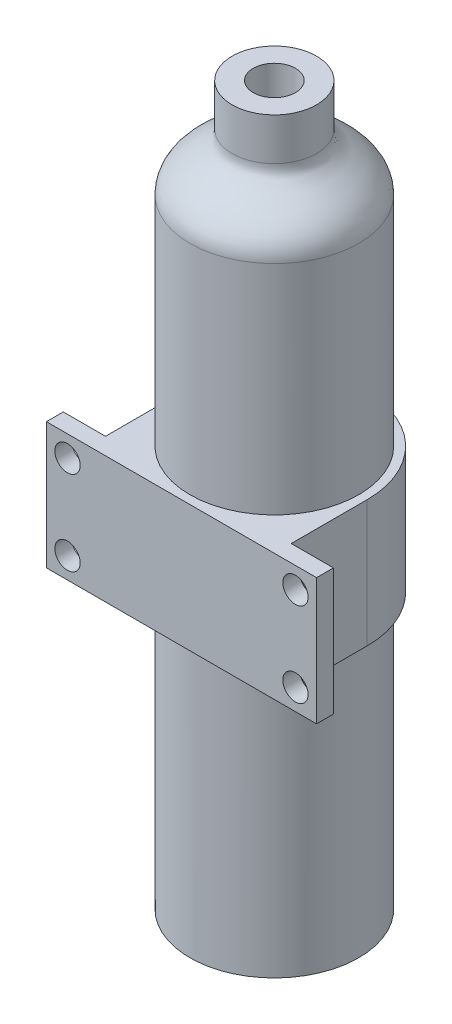
ISO-10303-21;
HEADER;
FILE_DESCRIPTION(('STEP AP214'),'2;1');
FILE_NAME('part.step','',(''),(''),'','','');
FILE_SCHEMA(('AUTOMOTIVE_DESIGN { 1 0 10303 214 1 1 1 1 }'));
ENDSEC;
DATA;
#1=APPLICATION_CONTEXT('core data for automotive mechanical design processes');
#2=APPLICATION_PROTOCOL_DEFINITION('international standard','automotive_design',2000,#1);
#3=PRODUCT_CONTEXT('',#1,'mechanical');
#4=PRODUCT('Part','Part','',(#3));
#5=PRODUCT_RELATED_PRODUCT_CATEGORY('part','',(#4));
#6=PRODUCT_DEFINITION_FORMATION('','',#4);
#7=PRODUCT_DEFINITION_CONTEXT('part definition',#1,'design');
#8=PRODUCT_DEFINITION('design','',#6,#7);
#9=PRODUCT_DEFINITION_SHAPE('','',#8);
#10=(LENGTH_UNIT() NAMED_UNIT(*) SI_UNIT(.MILLI.,.METRE.));
#11=(NAMED_UNIT(*) PLANE_ANGLE_UNIT() SI_UNIT($,.RADIAN.));
#12=(NAMED_UNIT(*) SI_UNIT($,.STERADIAN.) SOLID_ANGLE_UNIT());
#13=UNCERTAINTY_MEASURE_WITH_UNIT(LENGTH_MEASURE(1.E-05),#10,'distance_accuracy_value','');
#14=(GEOMETRIC_REPRESENTATION_CONTEXT(3) GLOBAL_UNCERTAINTY_ASSIGNED_CONTEXT((#13)) GLOBAL_UNIT_ASSIGNED_CONTEXT((#10,
#11,#12)) REPRESENTATION_CONTEXT('',''));
#15=CARTESIAN_POINT('',(0.,0.,0.));
#16=DIRECTION('',(0.,0.,1.));
#17=DIRECTION('',(1.,0.,0.));
#18=AXIS2_PLACEMENT_3D('',#15,#16,#17);
#19=CARTESIAN_POINT('',(10.,73.2783386948561,0.));
#20=CARTESIAN_POINT('',(10.,74.7124883333088,0.));
#21=CARTESIAN_POINT('',(8.86413325896538,76.2963021801879,0.));
#22=CARTESIAN_POINT('',(5.67921838337146,78.3380554247678,0.));
#23=CARTESIAN_POINT('',(5.,79.0049411055225,0.));
#24=CARTESIAN_POINT('',(5.,80.,0.));
#25=B_SPLINE_CURVE_WITH_KNOTS('',3,(#19,#20,#21,#22,#23,#24),.UNSPECIFIED.,.F.,.F.,(4,1,1,4),
(0.,0.573592634008202,0.80277958528906,1.),.UNSPECIFIED.);
#26=CARTESIAN_POINT('',(0.,0.,0.));
#27=DIRECTION('',(0.,-1.,0.));
#28=AXIS1_PLACEMENT('',#26,#27);
#29=SURFACE_OF_REVOLUTION('',#25,#28);
#30=CARTESIAN_POINT('',(0.,80.,0.));
#31=DIRECTION('',(0.,1.,0.));
#32=DIRECTION('',(0.,0.,1.));
#33=AXIS2_PLACEMENT_3D('',#30,#31,#32);
#34=CIRCLE('',#33,5.);
#35=CARTESIAN_POINT('',(0.,80.,5.));
#36=VERTEX_POINT('',#35);
#37=EDGE_CURVE('E240',#36,#36,#34,.T.);
#38=ORIENTED_EDGE('',*,*,#37,.F.);
#39=EDGE_LOOP('',(#38));
#40=FACE_BOUND('',#39,.T.);
#41=CARTESIAN_POINT('',(0.,73.2783386948561,0.));
#42=DIRECTION('',(0.,-1.,0.));
#43=DIRECTION('',(0.,0.,-1.));
#44=AXIS2_PLACEMENT_3D('',#41,#42,#43);
#45=CIRCLE('',#44,10.);
#46=CARTESIAN_POINT('',(0.,73.2783386948561,-10.));
#47=VERTEX_POINT('',#46);
#48=EDGE_CURVE('E50',#47,#47,#45,.T.);
#49=ORIENTED_EDGE('',*,*,#48,.F.);
#50=EDGE_LOOP('',(#49));
#51=FACE_BOUND('',#50,.T.);
#52=ADVANCED_FACE('F41',(#40,#51),#29,.F.);
#53=CARTESIAN_POINT('',(0.,0.,0.));
#54=DIRECTION('',(0.,-1.,0.));
#55=DIRECTION('',(0.,0.,-1.));
#56=AXIS2_PLACEMENT_3D('',#53,#54,#55);
#57=CYLINDRICAL_SURFACE('',#56,10.);
#58=CARTESIAN_POINT('',(0.,47.5,0.));
#59=DIRECTION('',(0.,1.,0.));
#60=DIRECTION('',(0.,0.,1.));
#61=AXIS2_PLACEMENT_3D('',#58,#59,#60);
#62=CIRCLE('',#61,10.);
#63=CARTESIAN_POINT('',(0.,47.5,10.));
#64=VERTEX_POINT('',#63);
#65=EDGE_CURVE('E11',#64,#64,#62,.F.);
#66=ORIENTED_EDGE('',*,*,#65,.F.);
#67=EDGE_LOOP('',(#66));
#68=FACE_BOUND('',#67,.T.);
#69=ORIENTED_EDGE('',*,*,#48,.T.);
#70=EDGE_LOOP('',(#69));
#71=FACE_BOUND('',#70,.T.);
#72=ADVANCED_FACE('F43',(#68,#71),#57,.T.);
#73=CARTESIAN_POINT('',(0.,85.,0.));
#74=DIRECTION('',(0.,-1.,0.));
#75=DIRECTION('',(0.,0.,-1.));
#76=AXIS2_PLACEMENT_3D('',#73,#74,#75);
#77=CYLINDRICAL_SURFACE('',#76,5.);
#78=CARTESIAN_POINT('',(0.,85.,0.));
#79=DIRECTION('',(0.,1.,0.));
#80=DIRECTION('',(0.,0.,1.));
#81=AXIS2_PLACEMENT_3D('',#78,#79,#80);
#82=CIRCLE('',#81,5.);
#83=CARTESIAN_POINT('',(0.,85.,5.));
#84=VERTEX_POINT('',#83);
#85=EDGE_CURVE('E235',#84,#84,#82,.T.);
#86=ORIENTED_EDGE('',*,*,#85,.F.);
#87=EDGE_LOOP('',(#86));
#88=FACE_BOUND('',#87,.T.);
#89=ORIENTED_EDGE('',*,*,#37,.T.);
#90=EDGE_LOOP('',(#89));
#91=FACE_BOUND('',#90,.T.);
#92=ADVANCED_FACE('F216',(#88,#91),#77,.T.);
#93=CARTESIAN_POINT('',(0.,85.,0.));
#94=DIRECTION('',(0.,1.,0.));
#95=DIRECTION('',(0.,0.,1.));
#96=AXIS2_PLACEMENT_3D('',#93,#94,#95);
#97=PLANE('',#96);
#98=CARTESIAN_POINT('',(0.,85.,0.));
#99=DIRECTION('',(0.,1.,0.));
#100=DIRECTION('',(0.,0.,1.));
#101=AXIS2_PLACEMENT_3D('',#98,#99,#100);
#102=CIRCLE('',#101,2.5);
#103=CARTESIAN_POINT('',(0.,85.,2.5));
#104=VERTEX_POINT('',#103);
#105=EDGE_CURVE('E304',#104,#104,#102,.T.);
#106=ORIENTED_EDGE('',*,*,#105,.F.);
#107=EDGE_LOOP('',(#106));
#108=FACE_BOUND('',#107,.T.);
#109=ORIENTED_EDGE('',*,*,#85,.T.);
#110=EDGE_LOOP('',(#109));
#111=FACE_BOUND('',#110,.T.);
#112=ADVANCED_FACE('F212',(#108,#111),#97,.T.);
#113=CARTESIAN_POINT('',(0.,75.,0.));
#114=DIRECTION('',(0.,1.,0.));
#115=DIRECTION('',(0.,0.,1.));
#116=AXIS2_PLACEMENT_3D('',#113,#114,#115);
#117=CYLINDRICAL_SURFACE('',#116,2.5);
#118=CARTESIAN_POINT('',(0.,75.,0.));
#119=DIRECTION('',(0.,1.,0.));
#120=DIRECTION('',(0.,0.,1.));
#121=AXIS2_PLACEMENT_3D('',#118,#119,#120);
#122=CIRCLE('',#121,2.5);
#123=CARTESIAN_POINT('',(0.,75.,2.5));
#124=VERTEX_POINT('',#123);
#125=EDGE_CURVE('E301',#124,#124,#122,.T.);
#126=ORIENTED_EDGE('',*,*,#125,.F.);
#127=EDGE_LOOP('',(#126));
#128=FACE_BOUND('',#127,.T.);
#129=ORIENTED_EDGE('',*,*,#105,.T.);
#130=EDGE_LOOP('',(#129));
#131=FACE_BOUND('',#130,.T.);
#132=ADVANCED_FACE('F209',(#128,#131),#117,.F.);
#133=CARTESIAN_POINT('',(10.,73.2783386948561,0.));
#134=CARTESIAN_POINT('',(10.,74.7124883333088,0.));
#135=CARTESIAN_POINT('',(8.86413325896538,76.2963021801879,0.));
#136=CARTESIAN_POINT('',(5.67921838337146,78.3380554247678,0.));
#137=CARTESIAN_POINT('',(5.,79.0049411055225,0.));
#138=CARTESIAN_POINT('',(5.,80.,0.));
#139=B_SPLINE_CURVE_WITH_KNOTS('',3,(#133,#134,#135,#136,#137,#138),.UNSPECIFIED.,.F.,.F.,(4,1,
1,4),(0.,0.573592634008202,0.80277958528906,1.),.UNSPECIFIED.);
#140=CARTESIAN_POINT('',(0.,0.,0.));
#141=DIRECTION('',(0.,-1.,0.));
#142=AXIS1_PLACEMENT('',#140,#141);
#143=SURFACE_OF_REVOLUTION('',#139,#142);
#144=OFFSET_SURFACE('',#143,2.,.F.);
#145=CARTESIAN_POINT('',(0.,73.2783386948561,0.));
#146=DIRECTION('',(0.,-1.,0.));
#147=DIRECTION('',(0.,0.,-1.));
#148=AXIS2_PLACEMENT_3D('',#145,#146,#147);
#149=CIRCLE('',#148,8.);
#150=CARTESIAN_POINT('',(0.,73.2783386948561,-8.));
#151=VERTEX_POINT('',#150);
#152=EDGE_CURVE('E170',#151,#151,#149,.T.);
#153=ORIENTED_EDGE('',*,*,#152,.T.);
#154=EDGE_LOOP('',(#153));
#155=FACE_BOUND('',#154,.T.);
#156=CARTESIAN_POINT('',(0.,76.8009969156272,0.));
#157=DIRECTION('',(0.,-1.,0.));
#158=DIRECTION('',(0.,0.,-1.));
#159=AXIS2_PLACEMENT_3D('',#156,#157,#158);
#160=CIRCLE('',#159,4.49999999999997);
#161=CARTESIAN_POINT('',(0.,76.8009969156272,-4.49999999999997));
#162=VERTEX_POINT('',#161);
#163=EDGE_CURVE('E173',#162,#162,#160,.T.);
#164=ORIENTED_EDGE('',*,*,#163,.F.);
#165=EDGE_LOOP('',(#164));
#166=FACE_BOUND('',#165,.T.);
#167=ADVANCED_FACE('F194',(#155,#166),#144,.T.);
#168=CARTESIAN_POINT('',(0.,0.,0.));
#169=DIRECTION('',(0.,-1.,0.));
#170=DIRECTION('',(0.,0.,-1.));
#171=AXIS2_PLACEMENT_3D('',#168,#169,#170);
#172=CYLINDRICAL_SURFACE('',#171,8.);
#173=ORIENTED_EDGE('',*,*,#152,.F.);
#174=EDGE_LOOP('',(#173));
#175=FACE_BOUND('',#174,.T.);
#176=CARTESIAN_POINT('',(0.,2.,0.));
#177=DIRECTION('',(0.,-1.,0.));
#178=DIRECTION('',(0.,0.,-1.));
#179=AXIS2_PLACEMENT_3D('',#176,#177,#178);
#180=CIRCLE('',#179,8.);
#181=CARTESIAN_POINT('',(0.,2.,-8.));
#182=VERTEX_POINT('',#181);
#183=EDGE_CURVE('E174',#182,#182,#180,.T.);
#184=ORIENTED_EDGE('',*,*,#183,.T.);
#185=EDGE_LOOP('',(#184));
#186=FACE_BOUND('',#185,.T.);
#187=ADVANCED_FACE('F196',(#175,#186),#172,.F.);
#188=CARTESIAN_POINT('',(10.,2.,0.));
#189=DIRECTION('',(0.,-1.,0.));
#190=DIRECTION('',(0.,0.,-1.));
#191=AXIS2_PLACEMENT_3D('',#188,#189,#190);
#192=PLANE('',#191);
#193=ORIENTED_EDGE('',*,*,#183,.F.);
#194=EDGE_LOOP('',(#193));
#195=FACE_BOUND('',#194,.T.);
#196=ADVANCED_FACE('F199',(#195),#192,.F.);
#197=CARTESIAN_POINT('',(0.,75.,0.));
#198=DIRECTION('',(0.,1.,0.));
#199=DIRECTION('',(0.,0.,1.));
#200=AXIS2_PLACEMENT_3D('',#197,#198,#199);
#201=CYLINDRICAL_SURFACE('',#200,4.5);
#202=ORIENTED_EDGE('',*,*,#163,.T.);
#203=EDGE_LOOP('',(#202));
#204=FACE_BOUND('',#203,.T.);
#205=CARTESIAN_POINT('',(0.,75.,0.));
#206=DIRECTION('',(0.,1.,0.));
#207=DIRECTION('',(0.,0.,1.));
#208=AXIS2_PLACEMENT_3D('',#205,#206,#207);
#209=CIRCLE('',#208,4.5);
#210=CARTESIAN_POINT('',(0.,75.,4.5));
#211=VERTEX_POINT('',#210);
#212=EDGE_CURVE('E177',#211,#211,#209,.T.);
#213=ORIENTED_EDGE('',*,*,#212,.T.);
#214=EDGE_LOOP('',(#213));
#215=FACE_BOUND('',#214,.T.);
#216=ADVANCED_FACE('F203',(#204,#215),#201,.T.);
#217=CARTESIAN_POINT('',(0.,75.,0.));
#218=DIRECTION('',(0.,1.,0.));
#219=DIRECTION('',(0.,0.,1.));
#220=AXIS2_PLACEMENT_3D('',#217,#218,#219);
#221=PLANE('',#220);
#222=ORIENTED_EDGE('',*,*,#125,.T.);
#223=EDGE_LOOP('',(#222));
#224=FACE_BOUND('',#223,.T.);
#225=ORIENTED_EDGE('',*,*,#212,.F.);
#226=EDGE_LOOP('',(#225));
#227=FACE_BOUND('',#226,.T.);
#228=ADVANCED_FACE('F207',(#224,#227),#221,.F.);
#229=CARTESIAN_POINT('',(0.,47.5,0.));
#230=DIRECTION('',(0.,1.,0.));
#231=DIRECTION('',(0.,0.,1.));
#232=AXIS2_PLACEMENT_3D('',#229,#230,#231);
#233=PLANE('',#232);
#234=ORIENTED_EDGE('',*,*,#65,.T.);
#235=EDGE_LOOP('',(#234));
#236=FACE_BOUND('',#235,.T.);
#237=CARTESIAN_POINT('',(0.,47.5,0.));
#238=DIRECTION('',(0.,1.,0.));
#239=DIRECTION('',(0.,0.,1.));
#240=AXIS2_PLACEMENT_3D('',#237,#238,#239);
#241=CIRCLE('',#240,11.);
#242=CARTESIAN_POINT('',(11.,47.5,0.));
#243=VERTEX_POINT('',#242);
#244=CARTESIAN_POINT('',(-11.,47.5,0.));
#245=VERTEX_POINT('',#244);
#246=EDGE_CURVE('E154',#243,#245,#241,.T.);
#247=ORIENTED_EDGE('',*,*,#246,.T.);
#248=DIRECTION('',(0.,0.,1.));
#249=VECTOR('',#248,1.);
#250=CARTESIAN_POINT('',(-11.,47.5,0.));
#251=LINE('',#250,#249);
#252=CARTESIAN_POINT('',(-11.,47.5,9.));
#253=VERTEX_POINT('',#252);
#254=EDGE_CURVE('E102',#245,#253,#251,.T.);
#255=ORIENTED_EDGE('',*,*,#254,.T.);
#256=DIRECTION('',(-1.,0.,0.));
#257=VECTOR('',#256,1.);
#258=CARTESIAN_POINT('',(-11.,47.5,9.));
#259=LINE('',#258,#257);
#260=CARTESIAN_POINT('',(-16.,47.5,9.));
#261=VERTEX_POINT('',#260);
#262=EDGE_CURVE('E258',#253,#261,#259,.T.);
#263=ORIENTED_EDGE('',*,*,#262,.T.);
#264=DIRECTION('',(0.,0.,1.));
#265=VECTOR('',#264,1.);
#266=CARTESIAN_POINT('',(-16.,47.5,9.));
#267=LINE('',#266,#265);
#268=CARTESIAN_POINT('',(-16.,47.5,11.));
#269=VERTEX_POINT('',#268);
#270=EDGE_CURVE('E265',#261,#269,#267,.T.);
#271=ORIENTED_EDGE('',*,*,#270,.T.);
#272=DIRECTION('',(1.,0.,0.));
#273=VECTOR('',#272,1.);
#274=CARTESIAN_POINT('',(-16.,47.5,11.));
#275=LINE('',#274,#273);
#276=CARTESIAN_POINT('',(16.,47.5,11.));
#277=VERTEX_POINT('',#276);
#278=EDGE_CURVE('E121',#269,#277,#275,.T.);
#279=ORIENTED_EDGE('',*,*,#278,.T.);
#280=DIRECTION('',(0.,0.,-1.));
#281=VECTOR('',#280,1.);
#282=CARTESIAN_POINT('',(16.,47.5,11.));
#283=LINE('',#282,#281);
#284=CARTESIAN_POINT('',(16.,47.5,9.));
#285=VERTEX_POINT('',#284);
#286=EDGE_CURVE('E115',#277,#285,#283,.T.);
#287=ORIENTED_EDGE('',*,*,#286,.T.);
#288=DIRECTION('',(-1.,0.,0.));
#289=VECTOR('',#288,1.);
#290=CARTESIAN_POINT('',(16.,47.5,9.));
#291=LINE('',#290,#289);
#292=CARTESIAN_POINT('',(11.,47.5,9.));
#293=VERTEX_POINT('',#292);
#294=EDGE_CURVE('E119',#285,#293,#291,.T.);
#295=ORIENTED_EDGE('',*,*,#294,.T.);
#296=DIRECTION('',(0.,0.,-1.));
#297=VECTOR('',#296,1.);
#298=CARTESIAN_POINT('',(11.,47.5,9.));
#299=LINE('',#298,#297);
#300=EDGE_CURVE('E58',#293,#243,#299,.T.);
#301=ORIENTED_EDGE('',*,*,#300,.T.);
#302=EDGE_LOOP('',(#247,#255,#263,#271,#279,#287,#295,#301));
#303=FACE_BOUND('',#302,.T.);
#304=ADVANCED_FACE('F117',(#236,#303),#233,.T.);
#305=CARTESIAN_POINT('',(0.,32.5,0.));
#306=DIRECTION('',(0.,1.,0.));
#307=DIRECTION('',(0.,0.,1.));
#308=AXIS2_PLACEMENT_3D('',#305,#306,#307);
#309=PLANE('',#308);
#310=CARTESIAN_POINT('',(0.,32.5,0.));
#311=DIRECTION('',(0.,1.,0.));
#312=DIRECTION('',(0.,0.,1.));
#313=AXIS2_PLACEMENT_3D('',#310,#311,#312);
#314=CIRCLE('',#313,10.);
#315=CARTESIAN_POINT('',(0.,32.5,10.));
#316=VERTEX_POINT('',#315);
#317=EDGE_CURVE('E169',#316,#316,#314,.F.);
#318=ORIENTED_EDGE('',*,*,#317,.F.);
#319=EDGE_LOOP('',(#318));
#320=FACE_BOUND('',#319,.T.);
#321=CARTESIAN_POINT('',(0.,32.5,0.));
#322=DIRECTION('',(0.,1.,0.));
#323=DIRECTION('',(0.,0.,1.));
#324=AXIS2_PLACEMENT_3D('',#321,#322,#323);
#325=CIRCLE('',#324,11.);
#326=CARTESIAN_POINT('',(11.,32.5,0.));
#327=VERTEX_POINT('',#326);
#328=CARTESIAN_POINT('',(-11.,32.5,0.));
#329=VERTEX_POINT('',#328);
#330=EDGE_CURVE('E139',#327,#329,#325,.T.);
#331=ORIENTED_EDGE('',*,*,#330,.F.);
#332=DIRECTION('',(0.,0.,-1.));
#333=VECTOR('',#332,1.);
#334=CARTESIAN_POINT('',(11.,32.5,9.));
#335=LINE('',#334,#333);
#336=CARTESIAN_POINT('',(11.,32.5,9.));
#337=VERTEX_POINT('',#336);
#338=EDGE_CURVE('E93',#337,#327,#335,.T.);
#339=ORIENTED_EDGE('',*,*,#338,.F.);
#340=DIRECTION('',(-1.,0.,0.));
#341=VECTOR('',#340,1.);
#342=CARTESIAN_POINT('',(16.,32.5,9.));
#343=LINE('',#342,#341);
#344=CARTESIAN_POINT('',(16.,32.5,9.));
#345=VERTEX_POINT('',#344);
#346=EDGE_CURVE('E87',#345,#337,#343,.T.);
#347=ORIENTED_EDGE('',*,*,#346,.F.);
#348=DIRECTION('',(0.,0.,-1.));
#349=VECTOR('',#348,1.);
#350=CARTESIAN_POINT('',(16.,32.5,11.));
#351=LINE('',#350,#349);
#352=CARTESIAN_POINT('',(16.,32.5,11.));
#353=VERTEX_POINT('',#352);
#354=EDGE_CURVE('E129',#353,#345,#351,.T.);
#355=ORIENTED_EDGE('',*,*,#354,.F.);
#356=DIRECTION('',(1.,0.,0.));
#357=VECTOR('',#356,1.);
#358=CARTESIAN_POINT('',(-16.,32.5,11.));
#359=LINE('',#358,#357);
#360=CARTESIAN_POINT('',(-16.,32.5,11.));
#361=VERTEX_POINT('',#360);
#362=EDGE_CURVE('E149',#361,#353,#359,.T.);
#363=ORIENTED_EDGE('',*,*,#362,.F.);
#364=DIRECTION('',(0.,0.,1.));
#365=VECTOR('',#364,1.);
#366=CARTESIAN_POINT('',(-16.,32.5,9.));
#367=LINE('',#366,#365);
#368=CARTESIAN_POINT('',(-16.,32.5,9.));
#369=VERTEX_POINT('',#368);
#370=EDGE_CURVE('E147',#369,#361,#367,.T.);
#371=ORIENTED_EDGE('',*,*,#370,.F.);
#372=DIRECTION('',(-1.,0.,0.));
#373=VECTOR('',#372,1.);
#374=CARTESIAN_POINT('',(-11.,32.5,9.));
#375=LINE('',#374,#373);
#376=CARTESIAN_POINT('',(-11.,32.5,9.));
#377=VERTEX_POINT('',#376);
#378=EDGE_CURVE('E145',#377,#369,#375,.T.);
#379=ORIENTED_EDGE('',*,*,#378,.F.);
#380=DIRECTION('',(0.,0.,1.));
#381=VECTOR('',#380,1.);
#382=CARTESIAN_POINT('',(-11.,32.5,0.));
#383=LINE('',#382,#381);
#384=EDGE_CURVE('E142',#329,#377,#383,.T.);
#385=ORIENTED_EDGE('',*,*,#384,.F.);
#386=EDGE_LOOP('',(#331,#339,#347,#355,#363,#371,#379,#385));
#387=FACE_BOUND('',#386,.T.);
#388=ADVANCED_FACE('F247',(#320,#387),#309,.F.);
#389=CARTESIAN_POINT('',(0.,47.5,0.));
#390=DIRECTION('',(0.,-1.,0.));
#391=DIRECTION('',(0.,0.,-1.));
#392=AXIS2_PLACEMENT_3D('',#389,#390,#391);
#393=CYLINDRICAL_SURFACE('',#392,11.);
#394=ORIENTED_EDGE('',*,*,#330,.T.);
#395=DIRECTION('',(0.,-1.,0.));
#396=VECTOR('',#395,1.);
#397=CARTESIAN_POINT('',(-11.,47.5,0.));
#398=LINE('',#397,#396);
#399=EDGE_CURVE('E167',#245,#329,#398,.T.);
#400=ORIENTED_EDGE('',*,*,#399,.F.);
#401=ORIENTED_EDGE('',*,*,#246,.F.);
#402=DIRECTION('',(0.,-1.,0.));
#403=VECTOR('',#402,1.);
#404=CARTESIAN_POINT('',(11.,47.5,0.));
#405=LINE('',#404,#403);
#406=EDGE_CURVE('E135',#243,#327,#405,.T.);
#407=ORIENTED_EDGE('',*,*,#406,.T.);
#408=EDGE_LOOP('',(#394,#400,#401,#407));
#409=FACE_BOUND('',#408,.T.);
#410=ADVANCED_FACE('F250',(#409),#393,.T.);
#411=CARTESIAN_POINT('',(-11.,47.5,0.));
#412=DIRECTION('',(1.,0.,0.));
#413=DIRECTION('',(0.,0.,-1.));
#414=AXIS2_PLACEMENT_3D('',#411,#412,#413);
#415=PLANE('',#414);
#416=ORIENTED_EDGE('',*,*,#384,.T.);
#417=DIRECTION('',(0.,-1.,0.));
#418=VECTOR('',#417,1.);
#419=CARTESIAN_POINT('',(-11.,47.5,9.));
#420=LINE('',#419,#418);
#421=EDGE_CURVE('E164',#253,#377,#420,.T.);
#422=ORIENTED_EDGE('',*,*,#421,.F.);
#423=ORIENTED_EDGE('',*,*,#254,.F.);
#424=ORIENTED_EDGE('',*,*,#399,.T.);
#425=EDGE_LOOP('',(#416,#422,#423,#424));
#426=FACE_BOUND('',#425,.T.);
#427=ADVANCED_FACE('F278',(#426),#415,.F.);
#428=CARTESIAN_POINT('',(-11.,47.5,9.));
#429=DIRECTION('',(0.,0.,1.));
#430=DIRECTION('',(1.,0.,0.));
#431=AXIS2_PLACEMENT_3D('',#428,#429,#430);
#432=PLANE('',#431);
#433=CARTESIAN_POINT('',(-13.5,45.,9.));
#434=DIRECTION('',(0.,0.,-1.));
#435=DIRECTION('',(-1.,0.,0.));
#436=AXIS2_PLACEMENT_3D('',#433,#434,#435);
#437=CIRCLE('',#436,1.5);
#438=CARTESIAN_POINT('',(-15.,45.,9.));
#439=VERTEX_POINT('',#438);
#440=EDGE_CURVE('E456',#439,#439,#437,.T.);
#441=ORIENTED_EDGE('',*,*,#440,.F.);
#442=EDGE_LOOP('',(#441));
#443=FACE_BOUND('',#442,.T.);
#444=CARTESIAN_POINT('',(-13.5,35.,9.));
#445=DIRECTION('',(0.,0.,-1.));
#446=DIRECTION('',(-1.,0.,0.));
#447=AXIS2_PLACEMENT_3D('',#444,#445,#446);
#448=CIRCLE('',#447,1.5);
#449=CARTESIAN_POINT('',(-15.,35.,9.));
#450=VERTEX_POINT('',#449);
#451=EDGE_CURVE('E460',#450,#450,#448,.T.);
#452=ORIENTED_EDGE('',*,*,#451,.F.);
#453=EDGE_LOOP('',(#452));
#454=FACE_BOUND('',#453,.T.);
#455=ORIENTED_EDGE('',*,*,#378,.T.);
#456=DIRECTION('',(0.,-1.,0.));
#457=VECTOR('',#456,1.);
#458=CARTESIAN_POINT('',(-16.,47.5,9.));
#459=LINE('',#458,#457);
#460=EDGE_CURVE('E161',#261,#369,#459,.T.);
#461=ORIENTED_EDGE('',*,*,#460,.F.);
#462=ORIENTED_EDGE('',*,*,#262,.F.);
#463=ORIENTED_EDGE('',*,*,#421,.T.);
#464=EDGE_LOOP('',(#455,#461,#462,#463));
#465=FACE_BOUND('',#464,.T.);
#466=ADVANCED_FACE('F277',(#443,#454,#465),#432,.F.);
#467=CARTESIAN_POINT('',(-16.,47.5,9.));
#468=DIRECTION('',(1.,0.,0.));
#469=DIRECTION('',(0.,0.,-1.));
#470=AXIS2_PLACEMENT_3D('',#467,#468,#469);
#471=PLANE('',#470);
#472=ORIENTED_EDGE('',*,*,#370,.T.);
#473=DIRECTION('',(0.,-1.,0.));
#474=VECTOR('',#473,1.);
#475=CARTESIAN_POINT('',(-16.,47.5,11.));
#476=LINE('',#475,#474);
#477=EDGE_CURVE('E158',#269,#361,#476,.T.);
#478=ORIENTED_EDGE('',*,*,#477,.F.);
#479=ORIENTED_EDGE('',*,*,#270,.F.);
#480=ORIENTED_EDGE('',*,*,#460,.T.);
#481=EDGE_LOOP('',(#472,#478,#479,#480));
#482=FACE_BOUND('',#481,.T.);
#483=ADVANCED_FACE('F271',(#482),#471,.F.);
#484=CARTESIAN_POINT('',(-16.,47.5,11.));
#485=DIRECTION('',(0.,0.,-1.));
#486=DIRECTION('',(-1.,0.,0.));
#487=AXIS2_PLACEMENT_3D('',#484,#485,#486);
#488=PLANE('',#487);
#489=CARTESIAN_POINT('',(-13.5,45.,11.));
#490=DIRECTION('',(0.,0.,-1.));
#491=DIRECTION('',(-1.,0.,0.));
#492=AXIS2_PLACEMENT_3D('',#489,#490,#491);
#493=CIRCLE('',#492,1.5);
#494=CARTESIAN_POINT('',(-15.,45.,11.));
#495=VERTEX_POINT('',#494);
#496=EDGE_CURVE('E453',#495,#495,#493,.T.);
#497=ORIENTED_EDGE('',*,*,#496,.T.);
#498=EDGE_LOOP('',(#497));
#499=FACE_BOUND('',#498,.T.);
#500=CARTESIAN_POINT('',(-13.5,35.,11.));
#501=DIRECTION('',(0.,0.,-1.));
#502=DIRECTION('',(-1.,0.,0.));
#503=AXIS2_PLACEMENT_3D('',#500,#501,#502);
#504=CIRCLE('',#503,1.5);
#505=CARTESIAN_POINT('',(-15.,35.,11.));
#506=VERTEX_POINT('',#505);
#507=EDGE_CURVE('E457',#506,#506,#504,.T.);
#508=ORIENTED_EDGE('',*,*,#507,.T.);
#509=EDGE_LOOP('',(#508));
#510=FACE_BOUND('',#509,.T.);
#511=CARTESIAN_POINT('',(13.5,35.,11.));
#512=DIRECTION('',(0.,0.,-1.));
#513=DIRECTION('',(-1.,0.,0.));
#514=AXIS2_PLACEMENT_3D('',#511,#512,#513);
#515=CIRCLE('',#514,1.5);
#516=CARTESIAN_POINT('',(12.,35.,11.));
#517=VERTEX_POINT('',#516);
#518=EDGE_CURVE('E472',#517,#517,#515,.T.);
#519=ORIENTED_EDGE('',*,*,#518,.T.);
#520=EDGE_LOOP('',(#519));
#521=FACE_BOUND('',#520,.T.);
#522=CARTESIAN_POINT('',(13.5,45.,11.));
#523=DIRECTION('',(0.,0.,-1.));
#524=DIRECTION('',(-1.,0.,0.));
#525=AXIS2_PLACEMENT_3D('',#522,#523,#524);
#526=CIRCLE('',#525,1.5);
#527=CARTESIAN_POINT('',(12.,45.,11.));
#528=VERTEX_POINT('',#527);
#529=EDGE_CURVE('E143',#528,#528,#526,.T.);
#530=ORIENTED_EDGE('',*,*,#529,.T.);
#531=EDGE_LOOP('',(#530));
#532=FACE_BOUND('',#531,.T.);
#533=ORIENTED_EDGE('',*,*,#362,.T.);
#534=DIRECTION('',(0.,-1.,0.));
#535=VECTOR('',#534,1.);
#536=CARTESIAN_POINT('',(16.,47.5,11.));
#537=LINE('',#536,#535);
#538=EDGE_CURVE('E130',#277,#353,#537,.T.);
#539=ORIENTED_EDGE('',*,*,#538,.F.);
#540=ORIENTED_EDGE('',*,*,#278,.F.);
#541=ORIENTED_EDGE('',*,*,#477,.T.);
#542=EDGE_LOOP('',(#533,#539,#540,#541));
#543=FACE_BOUND('',#542,.T.);
#544=ADVANCED_FACE('F275',(#499,#510,#521,#532,#543),#488,.F.);
#545=CARTESIAN_POINT('',(16.,47.5,11.));
#546=DIRECTION('',(-1.,0.,0.));
#547=DIRECTION('',(0.,0.,1.));
#548=AXIS2_PLACEMENT_3D('',#545,#546,#547);
#549=PLANE('',#548);
#550=ORIENTED_EDGE('',*,*,#354,.T.);
#551=DIRECTION('',(0.,-1.,0.));
#552=VECTOR('',#551,1.);
#553=CARTESIAN_POINT('',(16.,47.5,9.));
#554=LINE('',#553,#552);
#555=EDGE_CURVE('E126',#285,#345,#554,.T.);
#556=ORIENTED_EDGE('',*,*,#555,.F.);
#557=ORIENTED_EDGE('',*,*,#286,.F.);
#558=ORIENTED_EDGE('',*,*,#538,.T.);
#559=EDGE_LOOP('',(#550,#556,#557,#558));
#560=FACE_BOUND('',#559,.T.);
#561=ADVANCED_FACE('F127',(#560),#549,.F.);
#562=CARTESIAN_POINT('',(16.,47.5,9.));
#563=DIRECTION('',(0.,0.,1.));
#564=DIRECTION('',(1.,0.,0.));
#565=AXIS2_PLACEMENT_3D('',#562,#563,#564);
#566=PLANE('',#565);
#567=CARTESIAN_POINT('',(13.5,35.,9.));
#568=DIRECTION('',(0.,0.,-1.));
#569=DIRECTION('',(-1.,0.,0.));
#570=AXIS2_PLACEMENT_3D('',#567,#568,#569);
#571=CIRCLE('',#570,1.5);
#572=CARTESIAN_POINT('',(12.,35.,9.));
#573=VERTEX_POINT('',#572);
#574=EDGE_CURVE('E468',#573,#573,#571,.T.);
#575=ORIENTED_EDGE('',*,*,#574,.F.);
#576=EDGE_LOOP('',(#575));
#577=FACE_BOUND('',#576,.T.);
#578=CARTESIAN_POINT('',(13.5,45.,9.));
#579=DIRECTION('',(0.,0.,-1.));
#580=DIRECTION('',(-1.,0.,0.));
#581=AXIS2_PLACEMENT_3D('',#578,#579,#580);
#582=CIRCLE('',#581,1.5);
#583=CARTESIAN_POINT('',(12.,45.,9.));
#584=VERTEX_POINT('',#583);
#585=EDGE_CURVE('E261',#584,#584,#582,.T.);
#586=ORIENTED_EDGE('',*,*,#585,.F.);
#587=EDGE_LOOP('',(#586));
#588=FACE_BOUND('',#587,.T.);
#589=ORIENTED_EDGE('',*,*,#346,.T.);
#590=DIRECTION('',(0.,-1.,0.));
#591=VECTOR('',#590,1.);
#592=CARTESIAN_POINT('',(11.,47.5,9.));
#593=LINE('',#592,#591);
#594=EDGE_CURVE('E131',#293,#337,#593,.T.);
#595=ORIENTED_EDGE('',*,*,#594,.F.);
#596=ORIENTED_EDGE('',*,*,#294,.F.);
#597=ORIENTED_EDGE('',*,*,#555,.T.);
#598=EDGE_LOOP('',(#589,#595,#596,#597));
#599=FACE_BOUND('',#598,.T.);
#600=ADVANCED_FACE('F133',(#577,#588,#599),#566,.F.);
#601=CARTESIAN_POINT('',(11.,47.5,9.));
#602=DIRECTION('',(-1.,0.,0.));
#603=DIRECTION('',(0.,0.,1.));
#604=AXIS2_PLACEMENT_3D('',#601,#602,#603);
#605=PLANE('',#604);
#606=ORIENTED_EDGE('',*,*,#338,.T.);
#607=ORIENTED_EDGE('',*,*,#406,.F.);
#608=ORIENTED_EDGE('',*,*,#300,.F.);
#609=ORIENTED_EDGE('',*,*,#594,.T.);
#610=EDGE_LOOP('',(#606,#607,#608,#609));
#611=FACE_BOUND('',#610,.T.);
#612=ADVANCED_FACE('F223',(#611),#605,.F.);
#613=CARTESIAN_POINT('',(10.,0.,0.));
#614=DIRECTION('',(0.,-1.,0.));
#615=DIRECTION('',(0.,0.,-1.));
#616=AXIS2_PLACEMENT_3D('',#613,#614,#615);
#617=PLANE('',#616);
#618=CARTESIAN_POINT('',(0.,0.,0.));
#619=DIRECTION('',(0.,-1.,0.));
#620=DIRECTION('',(0.,0.,-1.));
#621=AXIS2_PLACEMENT_3D('',#618,#619,#620);
#622=CIRCLE('',#621,10.);
#623=CARTESIAN_POINT('',(0.,0.,-10.));
#624=VERTEX_POINT('',#623);
#625=EDGE_CURVE('E234',#624,#624,#622,.T.);
#626=ORIENTED_EDGE('',*,*,#625,.T.);
#627=EDGE_LOOP('',(#626));
#628=FACE_BOUND('',#627,.T.);
#629=ADVANCED_FACE('F220',(#628),#617,.T.);
#630=ORIENTED_EDGE('',*,*,#625,.F.);
#631=EDGE_LOOP('',(#630));
#632=FACE_BOUND('',#631,.T.);
#633=ORIENTED_EDGE('',*,*,#317,.T.);
#634=EDGE_LOOP('',(#633));
#635=FACE_BOUND('',#634,.T.);
#636=ADVANCED_FACE('F222',(#632,#635),#57,.T.);
#637=CARTESIAN_POINT('',(13.5,45.,11.));
#638=DIRECTION('',(0.,0.,-1.));
#639=DIRECTION('',(-1.,0.,0.));
#640=AXIS2_PLACEMENT_3D('',#637,#638,#639);
#641=CYLINDRICAL_SURFACE('',#640,1.5);
#642=ORIENTED_EDGE('',*,*,#529,.F.);
#643=EDGE_LOOP('',(#642));
#644=FACE_BOUND('',#643,.T.);
#645=ORIENTED_EDGE('',*,*,#585,.T.);
#646=EDGE_LOOP('',(#645));
#647=FACE_BOUND('',#646,.T.);
#648=ADVANCED_FACE('F228',(#644,#647),#641,.F.);
#649=CARTESIAN_POINT('',(13.5,35.,11.));
#650=DIRECTION('',(0.,0.,-1.));
#651=DIRECTION('',(-1.,0.,0.));
#652=AXIS2_PLACEMENT_3D('',#649,#650,#651);
#653=CYLINDRICAL_SURFACE('',#652,1.5);
#654=ORIENTED_EDGE('',*,*,#518,.F.);
#655=EDGE_LOOP('',(#654));
#656=FACE_BOUND('',#655,.T.);
#657=ORIENTED_EDGE('',*,*,#574,.T.);
#658=EDGE_LOOP('',(#657));
#659=FACE_BOUND('',#658,.T.);
#660=ADVANCED_FACE('F417',(#656,#659),#653,.F.);
#661=CARTESIAN_POINT('',(-13.5,35.,11.));
#662=DIRECTION('',(0.,0.,-1.));
#663=DIRECTION('',(-1.,0.,0.));
#664=AXIS2_PLACEMENT_3D('',#661,#662,#663);
#665=CYLINDRICAL_SURFACE('',#664,1.5);
#666=ORIENTED_EDGE('',*,*,#507,.F.);
#667=EDGE_LOOP('',(#666));
#668=FACE_BOUND('',#667,.T.);
#669=ORIENTED_EDGE('',*,*,#451,.T.);
#670=EDGE_LOOP('',(#669));
#671=FACE_BOUND('',#670,.T.);
#672=ADVANCED_FACE('F427',(#668,#671),#665,.F.);
#673=CARTESIAN_POINT('',(-13.5,45.,11.));
#674=DIRECTION('',(0.,0.,-1.));
#675=DIRECTION('',(-1.,0.,0.));
#676=AXIS2_PLACEMENT_3D('',#673,#674,#675);
#677=CYLINDRICAL_SURFACE('',#676,1.5);
#678=ORIENTED_EDGE('',*,*,#496,.F.);
#679=EDGE_LOOP('',(#678));
#680=FACE_BOUND('',#679,.T.);
#681=ORIENTED_EDGE('',*,*,#440,.T.);
#682=EDGE_LOOP('',(#681));
#683=FACE_BOUND('',#682,.T.);
#684=ADVANCED_FACE('F437',(#680,#683),#677,.F.);
#685=CLOSED_SHELL('',(#52,#72,#92,#112,#132,#167,#187,#196,#216,#228,#304,#388,#410,#427,#466,
#483,#544,#561,#600,#612,#629,#636,#648,#660,#672,#684));
#686=MANIFOLD_SOLID_BREP('B2',#685);
#687=ADVANCED_BREP_SHAPE_REPRESENTATION('',(#18,#686),#14);
#688=SHAPE_DEFINITION_REPRESENTATION(#9,#687);
ENDSEC;
END-ISO-10303-21;
